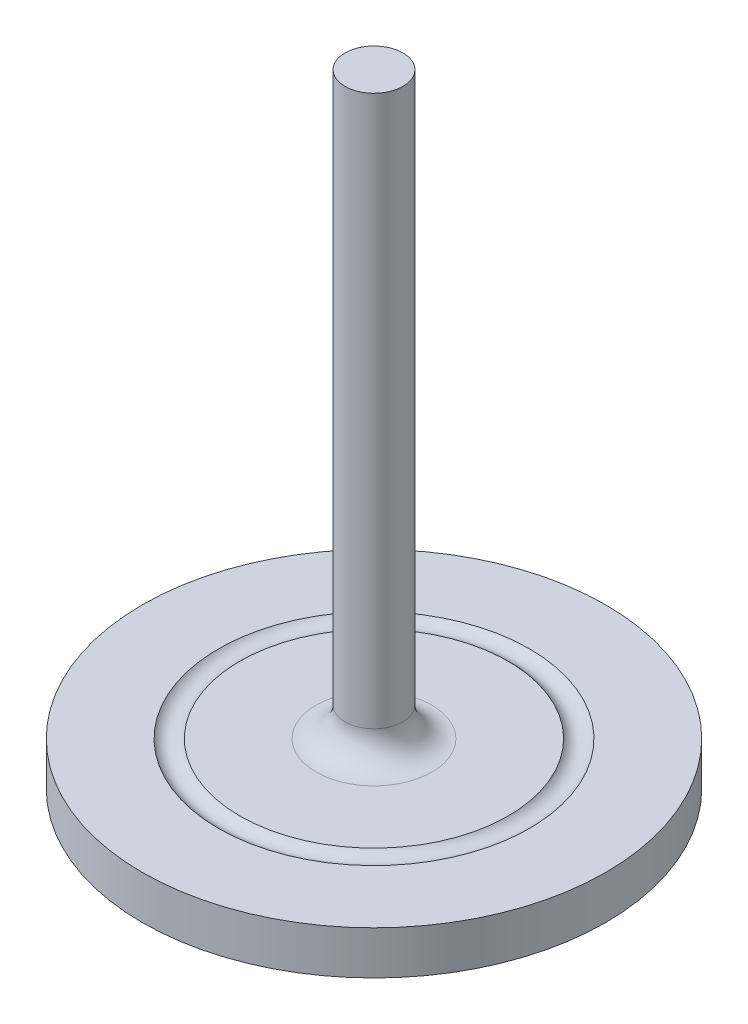
ISO-10303-21;
HEADER;
FILE_DESCRIPTION(('STEP AP214'),'2;1');
FILE_NAME('part.step','',(''),(''),'','','');
FILE_SCHEMA(('AUTOMOTIVE_DESIGN { 1 0 10303 214 1 1 1 1 }'));
ENDSEC;
DATA;
#1=APPLICATION_CONTEXT('core data for automotive mechanical design processes');
#2=APPLICATION_PROTOCOL_DEFINITION('international standard','automotive_design',2000,#1);
#3=PRODUCT_CONTEXT('',#1,'mechanical');
#4=PRODUCT('Part','Part','',(#3));
#5=PRODUCT_RELATED_PRODUCT_CATEGORY('part','',(#4));
#6=PRODUCT_DEFINITION_FORMATION('','',#4);
#7=PRODUCT_DEFINITION_CONTEXT('part definition',#1,'design');
#8=PRODUCT_DEFINITION('design','',#6,#7);
#9=PRODUCT_DEFINITION_SHAPE('','',#8);
#10=(LENGTH_UNIT() NAMED_UNIT(*) SI_UNIT(.MILLI.,.METRE.));
#11=(NAMED_UNIT(*) PLANE_ANGLE_UNIT() SI_UNIT($,.RADIAN.));
#12=(NAMED_UNIT(*) SI_UNIT($,.STERADIAN.) SOLID_ANGLE_UNIT());
#13=UNCERTAINTY_MEASURE_WITH_UNIT(LENGTH_MEASURE(1.E-05),#10,'distance_accuracy_value','');
#14=(GEOMETRIC_REPRESENTATION_CONTEXT(3) GLOBAL_UNCERTAINTY_ASSIGNED_CONTEXT((#13)) GLOBAL_UNIT_ASSIGNED_CONTEXT((#10,
#11,#12)) REPRESENTATION_CONTEXT('',''));
#15=CARTESIAN_POINT('',(0.,0.,0.));
#16=DIRECTION('',(0.,0.,1.));
#17=DIRECTION('',(1.,0.,0.));
#18=AXIS2_PLACEMENT_3D('',#15,#16,#17);
#19=CARTESIAN_POINT('',(0.,15.,0.));
#20=DIRECTION('',(0.,1.,0.));
#21=DIRECTION('',(0.,0.,1.));
#22=AXIS2_PLACEMENT_3D('',#19,#20,#21);
#23=PLANE('',#22);
#24=CARTESIAN_POINT('',(0.,15.,0.));
#25=DIRECTION('',(0.,1.,0.));
#26=DIRECTION('',(0.,0.,1.));
#27=AXIS2_PLACEMENT_3D('',#24,#25,#26);
#28=CIRCLE('',#27,20.);
#29=CARTESIAN_POINT('',(0.,15.,20.));
#30=VERTEX_POINT('',#29);
#31=EDGE_CURVE('E80',#30,#30,#28,.F.);
#32=ORIENTED_EDGE('',*,*,#31,.T.);
#33=EDGE_LOOP('',(#32));
#34=FACE_BOUND('',#33,.T.);
#35=CARTESIAN_POINT('',(0.,15.,0.));
#36=DIRECTION('',(0.,-1.,0.));
#37=DIRECTION('',(0.,0.,-1.));
#38=AXIS2_PLACEMENT_3D('',#35,#36,#37);
#39=CIRCLE('',#38,46.3011614998759);
#40=CARTESIAN_POINT('',(0.,15.,46.3011614998759));
#41=VERTEX_POINT('',#40);
#42=EDGE_CURVE('E56',#41,#41,#39,.T.);
#43=ORIENTED_EDGE('',*,*,#42,.F.);
#44=EDGE_LOOP('',(#43));
#45=FACE_BOUND('',#44,.T.);
#46=ADVANCED_FACE('F48',(#34,#45),#23,.T.);
#47=CARTESIAN_POINT('',(0.,215.,0.));
#48=DIRECTION('',(0.,-1.,0.));
#49=DIRECTION('',(0.,0.,-1.));
#50=AXIS2_PLACEMENT_3D('',#47,#48,#49);
#51=CYLINDRICAL_SURFACE('',#50,10.);
#52=CARTESIAN_POINT('',(0.,25.,0.));
#53=DIRECTION('',(0.,1.,0.));
#54=DIRECTION('',(0.,0.,1.));
#55=AXIS2_PLACEMENT_3D('',#52,#53,#54);
#56=CIRCLE('',#55,10.);
#57=CARTESIAN_POINT('',(0.,25.,10.));
#58=VERTEX_POINT('',#57);
#59=EDGE_CURVE('E75',#58,#58,#56,.T.);
#60=ORIENTED_EDGE('',*,*,#59,.T.);
#61=EDGE_LOOP('',(#60));
#62=FACE_BOUND('',#61,.T.);
#63=CARTESIAN_POINT('',(0.,215.,0.));
#64=DIRECTION('',(0.,1.,0.));
#65=DIRECTION('',(0.,0.,1.));
#66=AXIS2_PLACEMENT_3D('',#63,#64,#65);
#67=CIRCLE('',#66,10.);
#68=CARTESIAN_POINT('',(0.,215.,10.));
#69=VERTEX_POINT('',#68);
#70=EDGE_CURVE('E66',#69,#69,#67,.T.);
#71=ORIENTED_EDGE('',*,*,#70,.F.);
#72=EDGE_LOOP('',(#71));
#73=FACE_BOUND('',#72,.T.);
#74=ADVANCED_FACE('F91',(#62,#73),#51,.T.);
#75=CARTESIAN_POINT('',(0.,215.,0.));
#76=DIRECTION('',(0.,1.,0.));
#77=DIRECTION('',(0.,0.,1.));
#78=AXIS2_PLACEMENT_3D('',#75,#76,#77);
#79=PLANE('',#78);
#80=ORIENTED_EDGE('',*,*,#70,.T.);
#81=EDGE_LOOP('',(#80));
#82=FACE_BOUND('',#81,.T.);
#83=ADVANCED_FACE('F88',(#82),#79,.T.);
#84=CARTESIAN_POINT('',(0.,25.,0.));
#85=DIRECTION('',(0.,1.,0.));
#86=DIRECTION('',(0.,0.,1.));
#87=AXIS2_PLACEMENT_3D('',#84,#85,#86);
#88=TOROIDAL_SURFACE('',#87,20.,10.);
#89=ORIENTED_EDGE('',*,*,#31,.F.);
#90=EDGE_LOOP('',(#89));
#91=FACE_BOUND('',#90,.T.);
#92=ORIENTED_EDGE('',*,*,#59,.F.);
#93=EDGE_LOOP('',(#92));
#94=FACE_BOUND('',#93,.T.);
#95=ADVANCED_FACE('F50',(#91,#94),#88,.F.);
#96=CARTESIAN_POINT('',(0.,18.,0.));
#97=DIRECTION('',(0.,1.,0.));
#98=DIRECTION('',(0.,0.,1.));
#99=AXIS2_PLACEMENT_3D('',#96,#97,#98);
#100=TOROIDAL_SURFACE('',#99,50.,4.7625);
#101=CARTESIAN_POINT('',(0.,15.,0.));
#102=DIRECTION('',(0.,1.,0.));
#103=DIRECTION('',(0.,0.,1.));
#104=AXIS2_PLACEMENT_3D('',#101,#102,#103);
#105=CIRCLE('',#104,53.6988385001241);
#106=CARTESIAN_POINT('',(0.,15.,53.6988385001241));
#107=VERTEX_POINT('',#106);
#108=EDGE_CURVE('E12',#107,#107,#105,.T.);
#109=ORIENTED_EDGE('',*,*,#108,.T.);
#110=CARTESIAN_POINT('',(0.,18.,50.));
#111=DIRECTION('',(1.,0.,0.));
#112=DIRECTION('',(0.,1.,0.));
#113=AXIS2_PLACEMENT_3D('',#110,#111,#112);
#114=CIRCLE('',#113,4.7625);
#115=EDGE_CURVE('E62',#107,#41,#114,.T.);
#116=ORIENTED_EDGE('',*,*,#115,.T.);
#117=ORIENTED_EDGE('',*,*,#42,.T.);
#118=ORIENTED_EDGE('',*,*,#115,.F.);
#119=EDGE_LOOP('',(#109,#116,#117,#118));
#120=FACE_BOUND('',#119,.T.);
#121=ADVANCED_FACE('F63',(#120),#100,.F.);
#122=CARTESIAN_POINT('',(0.,0.,0.));
#123=DIRECTION('',(0.,1.,0.));
#124=DIRECTION('',(0.,0.,1.));
#125=AXIS2_PLACEMENT_3D('',#122,#123,#124);
#126=PLANE('',#125);
#127=CARTESIAN_POINT('',(0.,0.,0.));
#128=DIRECTION('',(0.,1.,0.));
#129=DIRECTION('',(0.,0.,1.));
#130=AXIS2_PLACEMENT_3D('',#127,#128,#129);
#131=CIRCLE('',#130,80.);
#132=CARTESIAN_POINT('',(0.,0.,80.));
#133=VERTEX_POINT('',#132);
#134=EDGE_CURVE('E69',#133,#133,#131,.T.);
#135=ORIENTED_EDGE('',*,*,#134,.F.);
#136=EDGE_LOOP('',(#135));
#137=FACE_BOUND('',#136,.T.);
#138=ADVANCED_FACE('F114',(#137),#126,.F.);
#139=CARTESIAN_POINT('',(0.,15.,0.));
#140=DIRECTION('',(0.,-1.,0.));
#141=DIRECTION('',(0.,0.,-1.));
#142=AXIS2_PLACEMENT_3D('',#139,#140,#141);
#143=CYLINDRICAL_SURFACE('',#142,80.);
#144=CARTESIAN_POINT('',(0.,15.,0.));
#145=DIRECTION('',(0.,1.,0.));
#146=DIRECTION('',(0.,0.,1.));
#147=AXIS2_PLACEMENT_3D('',#144,#145,#146);
#148=CIRCLE('',#147,80.);
#149=CARTESIAN_POINT('',(0.,15.,80.));
#150=VERTEX_POINT('',#149);
#151=EDGE_CURVE('E72',#150,#150,#148,.T.);
#152=ORIENTED_EDGE('',*,*,#151,.F.);
#153=EDGE_LOOP('',(#152));
#154=FACE_BOUND('',#153,.T.);
#155=ORIENTED_EDGE('',*,*,#134,.T.);
#156=EDGE_LOOP('',(#155));
#157=FACE_BOUND('',#156,.T.);
#158=ADVANCED_FACE('F109',(#154,#157),#143,.T.);
#159=ORIENTED_EDGE('',*,*,#151,.T.);
#160=EDGE_LOOP('',(#159));
#161=FACE_BOUND('',#160,.T.);
#162=ORIENTED_EDGE('',*,*,#108,.F.);
#163=EDGE_LOOP('',(#162));
#164=FACE_BOUND('',#163,.T.);
#165=ADVANCED_FACE('F104',(#161,#164),#23,.T.);
#166=CLOSED_SHELL('',(#46,#74,#83,#95,#121,#138,#158,#165));
#167=MANIFOLD_SOLID_BREP('B2',#166);
#168=ADVANCED_BREP_SHAPE_REPRESENTATION('',(#18,#167),#14);
#169=SHAPE_DEFINITION_REPRESENTATION(#9,#168);
ENDSEC;
END-ISO-10303-21;
